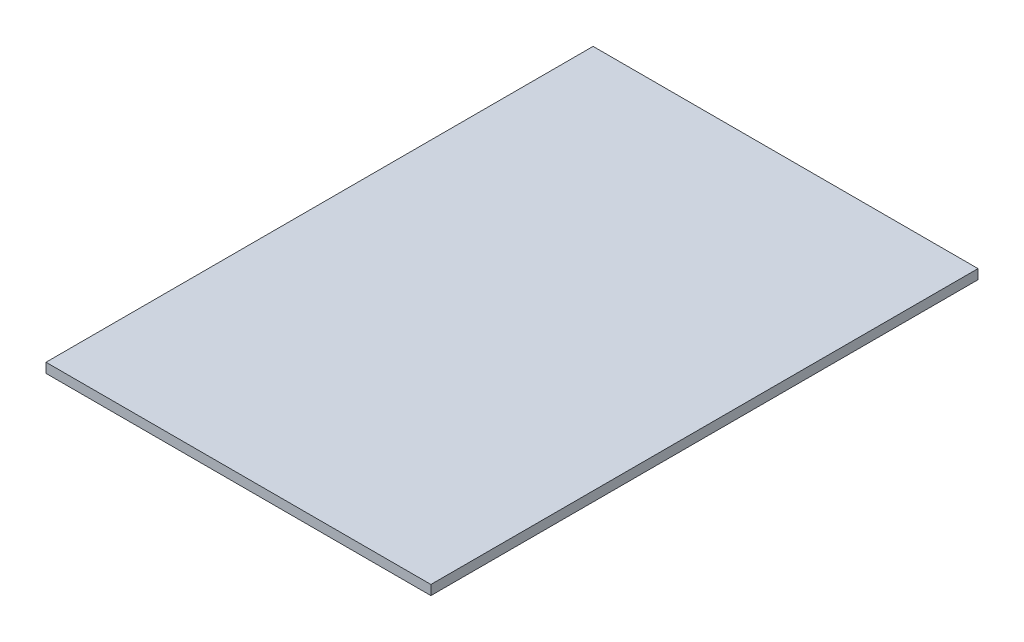
ISO-10303-21;
HEADER;
FILE_DESCRIPTION(('STEP AP214'),'2;1');
FILE_NAME('part.step','',(''),(''),'','','');
FILE_SCHEMA(('AUTOMOTIVE_DESIGN { 1 0 10303 214 1 1 1 1 }'));
ENDSEC;
DATA;
#1=APPLICATION_CONTEXT('core data for automotive mechanical design processes');
#2=APPLICATION_PROTOCOL_DEFINITION('international standard','automotive_design',2000,#1);
#3=PRODUCT_CONTEXT('',#1,'mechanical');
#4=PRODUCT('Part','Part','',(#3));
#5=PRODUCT_RELATED_PRODUCT_CATEGORY('part','',(#4));
#6=PRODUCT_DEFINITION_FORMATION('','',#4);
#7=PRODUCT_DEFINITION_CONTEXT('part definition',#1,'design');
#8=PRODUCT_DEFINITION('design','',#6,#7);
#9=PRODUCT_DEFINITION_SHAPE('','',#8);
#10=(LENGTH_UNIT() NAMED_UNIT(*) SI_UNIT(.MILLI.,.METRE.));
#11=(NAMED_UNIT(*) PLANE_ANGLE_UNIT() SI_UNIT($,.RADIAN.));
#12=(NAMED_UNIT(*) SI_UNIT($,.STERADIAN.) SOLID_ANGLE_UNIT());
#13=UNCERTAINTY_MEASURE_WITH_UNIT(LENGTH_MEASURE(1.E-05),#10,'distance_accuracy_value','');
#14=(GEOMETRIC_REPRESENTATION_CONTEXT(3) GLOBAL_UNCERTAINTY_ASSIGNED_CONTEXT((#13)) GLOBAL_UNIT_ASSIGNED_CONTEXT((#10,
#11,#12)) REPRESENTATION_CONTEXT('',''));
#15=CARTESIAN_POINT('',(0.,0.,0.));
#16=DIRECTION('',(0.,0.,1.));
#17=DIRECTION('',(1.,0.,0.));
#18=AXIS2_PLACEMENT_3D('',#15,#16,#17);
#19=CARTESIAN_POINT('',(0.,2.,0.));
#20=DIRECTION('',(1.,0.,0.));
#21=DIRECTION('',(0.,0.,-1.));
#22=AXIS2_PLACEMENT_3D('',#19,#20,#21);
#23=PLANE('',#22);
#24=DIRECTION('',(0.,0.,1.));
#25=VECTOR('',#24,1.);
#26=CARTESIAN_POINT('',(0.,0.,0.));
#27=LINE('',#26,#25);
#28=CARTESIAN_POINT('',(0.,0.,-113.));
#29=VERTEX_POINT('',#28);
#30=CARTESIAN_POINT('',(0.,0.,0.));
#31=VERTEX_POINT('',#30);
#32=EDGE_CURVE('E96',#29,#31,#27,.T.);
#33=ORIENTED_EDGE('',*,*,#32,.T.);
#34=DIRECTION('',(0.,-1.,0.));
#35=VECTOR('',#34,1.);
#36=CARTESIAN_POINT('',(0.,2.,0.));
#37=LINE('',#36,#35);
#38=CARTESIAN_POINT('',(0.,2.,0.));
#39=VERTEX_POINT('',#38);
#40=EDGE_CURVE('E11',#39,#31,#37,.T.);
#41=ORIENTED_EDGE('',*,*,#40,.F.);
#42=DIRECTION('',(0.,0.,1.));
#43=VECTOR('',#42,1.);
#44=CARTESIAN_POINT('',(0.,2.,0.));
#45=LINE('',#44,#43);
#46=CARTESIAN_POINT('',(0.,2.,-113.));
#47=VERTEX_POINT('',#46);
#48=EDGE_CURVE('E84',#47,#39,#45,.T.);
#49=ORIENTED_EDGE('',*,*,#48,.F.);
#50=DIRECTION('',(0.,-1.,0.));
#51=VECTOR('',#50,1.);
#52=CARTESIAN_POINT('',(0.,2.,-113.));
#53=LINE('',#52,#51);
#54=EDGE_CURVE('E92',#47,#29,#53,.T.);
#55=ORIENTED_EDGE('',*,*,#54,.T.);
#56=EDGE_LOOP('',(#33,#41,#49,#55));
#57=FACE_BOUND('',#56,.T.);
#58=ADVANCED_FACE('F33',(#57),#23,.F.);
#59=CARTESIAN_POINT('',(0.,2.,0.));
#60=DIRECTION('',(0.,0.,-1.));
#61=DIRECTION('',(-1.,0.,0.));
#62=AXIS2_PLACEMENT_3D('',#59,#60,#61);
#63=PLANE('',#62);
#64=DIRECTION('',(1.,0.,0.));
#65=VECTOR('',#64,1.);
#66=CARTESIAN_POINT('',(0.,0.,0.));
#67=LINE('',#66,#65);
#68=CARTESIAN_POINT('',(79.5,0.,0.));
#69=VERTEX_POINT('',#68);
#70=EDGE_CURVE('E88',#31,#69,#67,.T.);
#71=ORIENTED_EDGE('',*,*,#70,.T.);
#72=DIRECTION('',(0.,-1.,0.));
#73=VECTOR('',#72,1.);
#74=CARTESIAN_POINT('',(79.5,2.,0.));
#75=LINE('',#74,#73);
#76=CARTESIAN_POINT('',(79.5,2.,0.));
#77=VERTEX_POINT('',#76);
#78=EDGE_CURVE('E41',#77,#69,#75,.T.);
#79=ORIENTED_EDGE('',*,*,#78,.F.);
#80=DIRECTION('',(1.,0.,0.));
#81=VECTOR('',#80,1.);
#82=CARTESIAN_POINT('',(0.,2.,0.));
#83=LINE('',#82,#81);
#84=EDGE_CURVE('E79',#39,#77,#83,.T.);
#85=ORIENTED_EDGE('',*,*,#84,.F.);
#86=ORIENTED_EDGE('',*,*,#40,.T.);
#87=EDGE_LOOP('',(#71,#79,#85,#86));
#88=FACE_BOUND('',#87,.T.);
#89=ADVANCED_FACE('F87',(#88),#63,.F.);
#90=CARTESIAN_POINT('',(79.5,2.,0.));
#91=DIRECTION('',(-1.,0.,0.));
#92=DIRECTION('',(0.,0.,1.));
#93=AXIS2_PLACEMENT_3D('',#90,#91,#92);
#94=PLANE('',#93);
#95=DIRECTION('',(0.,0.,-1.));
#96=VECTOR('',#95,1.);
#97=CARTESIAN_POINT('',(79.5,0.,0.));
#98=LINE('',#97,#96);
#99=CARTESIAN_POINT('',(79.5,0.,-113.));
#100=VERTEX_POINT('',#99);
#101=EDGE_CURVE('E66',#69,#100,#98,.T.);
#102=ORIENTED_EDGE('',*,*,#101,.T.);
#103=DIRECTION('',(0.,-1.,0.));
#104=VECTOR('',#103,1.);
#105=CARTESIAN_POINT('',(79.5,2.,-113.));
#106=LINE('',#105,#104);
#107=CARTESIAN_POINT('',(79.5,2.,-113.));
#108=VERTEX_POINT('',#107);
#109=EDGE_CURVE('E89',#108,#100,#106,.T.);
#110=ORIENTED_EDGE('',*,*,#109,.F.);
#111=DIRECTION('',(0.,0.,-1.));
#112=VECTOR('',#111,1.);
#113=CARTESIAN_POINT('',(79.5,2.,0.));
#114=LINE('',#113,#112);
#115=EDGE_CURVE('E82',#77,#108,#114,.T.);
#116=ORIENTED_EDGE('',*,*,#115,.F.);
#117=ORIENTED_EDGE('',*,*,#78,.T.);
#118=EDGE_LOOP('',(#102,#110,#116,#117));
#119=FACE_BOUND('',#118,.T.);
#120=ADVANCED_FACE('F90',(#119),#94,.F.);
#121=CARTESIAN_POINT('',(0.,2.,-113.));
#122=DIRECTION('',(0.,0.,1.));
#123=DIRECTION('',(1.,0.,0.));
#124=AXIS2_PLACEMENT_3D('',#121,#122,#123);
#125=PLANE('',#124);
#126=DIRECTION('',(-1.,0.,0.));
#127=VECTOR('',#126,1.);
#128=CARTESIAN_POINT('',(0.,0.,-113.));
#129=LINE('',#128,#127);
#130=EDGE_CURVE('E72',#100,#29,#129,.T.);
#131=ORIENTED_EDGE('',*,*,#130,.T.);
#132=ORIENTED_EDGE('',*,*,#54,.F.);
#133=DIRECTION('',(-1.,0.,0.));
#134=VECTOR('',#133,1.);
#135=CARTESIAN_POINT('',(0.,2.,-113.));
#136=LINE('',#135,#134);
#137=EDGE_CURVE('E49',#108,#47,#136,.T.);
#138=ORIENTED_EDGE('',*,*,#137,.F.);
#139=ORIENTED_EDGE('',*,*,#109,.T.);
#140=EDGE_LOOP('',(#131,#132,#138,#139));
#141=FACE_BOUND('',#140,.T.);
#142=ADVANCED_FACE('F103',(#141),#125,.F.);
#143=CARTESIAN_POINT('',(0.,2.,0.));
#144=DIRECTION('',(0.,-1.,0.));
#145=DIRECTION('',(0.,0.,-1.));
#146=AXIS2_PLACEMENT_3D('',#143,#144,#145);
#147=PLANE('',#146);
#148=ORIENTED_EDGE('',*,*,#48,.T.);
#149=ORIENTED_EDGE('',*,*,#84,.T.);
#150=ORIENTED_EDGE('',*,*,#115,.T.);
#151=ORIENTED_EDGE('',*,*,#137,.T.);
#152=EDGE_LOOP('',(#148,#149,#150,#151));
#153=FACE_BOUND('',#152,.T.);
#154=ADVANCED_FACE('F80',(#153),#147,.F.);
#155=CARTESIAN_POINT('',(0.,0.,0.));
#156=DIRECTION('',(0.,-1.,0.));
#157=DIRECTION('',(0.,0.,-1.));
#158=AXIS2_PLACEMENT_3D('',#155,#156,#157);
#159=PLANE('',#158);
#160=ORIENTED_EDGE('',*,*,#32,.F.);
#161=ORIENTED_EDGE('',*,*,#130,.F.);
#162=ORIENTED_EDGE('',*,*,#101,.F.);
#163=ORIENTED_EDGE('',*,*,#70,.F.);
#164=EDGE_LOOP('',(#160,#161,#162,#163));
#165=FACE_BOUND('',#164,.T.);
#166=ADVANCED_FACE('F106',(#165),#159,.T.);
#167=CLOSED_SHELL('',(#58,#89,#120,#142,#154,#166));
#168=MANIFOLD_SOLID_BREP('B2',#167);
#169=ADVANCED_BREP_SHAPE_REPRESENTATION('',(#18,#168),#14);
#170=SHAPE_DEFINITION_REPRESENTATION(#9,#169);
ENDSEC;
END-ISO-10303-21;
